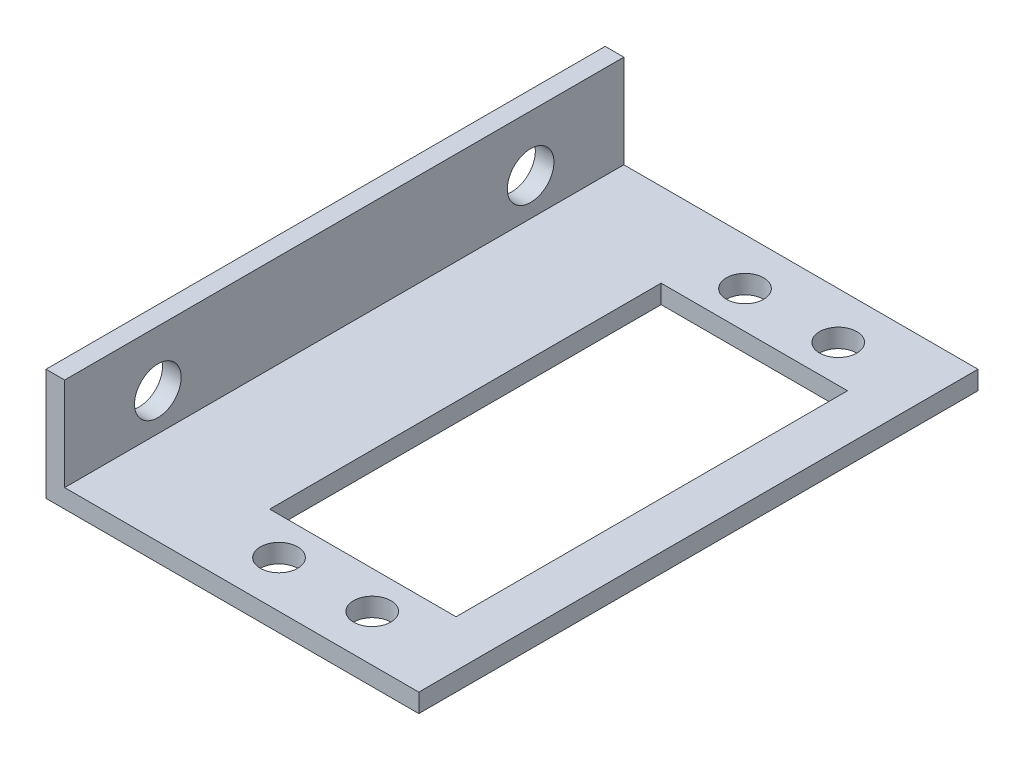
ISO-10303-21;
HEADER;
FILE_DESCRIPTION(('STEP AP214'),'2;1');
FILE_NAME('part.step','',(''),(''),'','','');
FILE_SCHEMA(('AUTOMOTIVE_DESIGN { 1 0 10303 214 1 1 1 1 }'));
ENDSEC;
DATA;
#1=APPLICATION_CONTEXT('core data for automotive mechanical design processes');
#2=APPLICATION_PROTOCOL_DEFINITION('international standard','automotive_design',2000,#1);
#3=PRODUCT_CONTEXT('',#1,'mechanical');
#4=PRODUCT('Part','Part','',(#3));
#5=PRODUCT_RELATED_PRODUCT_CATEGORY('part','',(#4));
#6=PRODUCT_DEFINITION_FORMATION('','',#4);
#7=PRODUCT_DEFINITION_CONTEXT('part definition',#1,'design');
#8=PRODUCT_DEFINITION('design','',#6,#7);
#9=PRODUCT_DEFINITION_SHAPE('','',#8);
#10=(LENGTH_UNIT() NAMED_UNIT(*) SI_UNIT(.MILLI.,.METRE.));
#11=(NAMED_UNIT(*) PLANE_ANGLE_UNIT() SI_UNIT($,.RADIAN.));
#12=(NAMED_UNIT(*) SI_UNIT($,.STERADIAN.) SOLID_ANGLE_UNIT());
#13=UNCERTAINTY_MEASURE_WITH_UNIT(LENGTH_MEASURE(1.E-05),#10,'distance_accuracy_value','');
#14=(GEOMETRIC_REPRESENTATION_CONTEXT(3) GLOBAL_UNCERTAINTY_ASSIGNED_CONTEXT((#13)) GLOBAL_UNIT_ASSIGNED_CONTEXT((#10,
#11,#12)) REPRESENTATION_CONTEXT('',''));
#15=CARTESIAN_POINT('',(0.,0.,0.));
#16=DIRECTION('',(0.,0.,1.));
#17=DIRECTION('',(1.,0.,0.));
#18=AXIS2_PLACEMENT_3D('',#15,#16,#17);
#19=CARTESIAN_POINT('',(22.2220554522577,2.,60.));
#20=DIRECTION('',(-1.,0.,0.));
#21=DIRECTION('',(0.,0.,1.));
#22=AXIS2_PLACEMENT_3D('',#19,#20,#21);
#23=PLANE('',#22);
#24=DIRECTION('',(0.,1.,0.));
#25=VECTOR('',#24,1.);
#26=CARTESIAN_POINT('',(22.2220554522577,2.,0.));
#27=LINE('',#26,#25);
#28=CARTESIAN_POINT('',(22.2220554522577,0.,0.));
#29=VERTEX_POINT('',#28);
#30=CARTESIAN_POINT('',(22.2220554522577,2.,0.));
#31=VERTEX_POINT('',#30);
#32=EDGE_CURVE('E196',#29,#31,#27,.T.);
#33=ORIENTED_EDGE('',*,*,#32,.T.);
#34=DIRECTION('',(0.,0.,-1.));
#35=VECTOR('',#34,1.);
#36=CARTESIAN_POINT('',(22.2220554522577,2.,60.));
#37=LINE('',#36,#35);
#38=CARTESIAN_POINT('',(22.2220554522577,2.,60.));
#39=VERTEX_POINT('',#38);
#40=EDGE_CURVE('E11',#39,#31,#37,.T.);
#41=ORIENTED_EDGE('',*,*,#40,.F.);
#42=DIRECTION('',(0.,1.,0.));
#43=VECTOR('',#42,1.);
#44=CARTESIAN_POINT('',(22.2220554522577,2.,60.));
#45=LINE('',#44,#43);
#46=CARTESIAN_POINT('',(22.2220554522577,0.,60.));
#47=VERTEX_POINT('',#46);
#48=EDGE_CURVE('E197',#47,#39,#45,.T.);
#49=ORIENTED_EDGE('',*,*,#48,.F.);
#50=DIRECTION('',(0.,0.,-1.));
#51=VECTOR('',#50,1.);
#52=CARTESIAN_POINT('',(22.2220554522577,0.,60.));
#53=LINE('',#52,#51);
#54=EDGE_CURVE('E217',#47,#29,#53,.T.);
#55=ORIENTED_EDGE('',*,*,#54,.T.);
#56=EDGE_LOOP('',(#33,#41,#49,#55));
#57=FACE_BOUND('',#56,.T.);
#58=ADVANCED_FACE('F39',(#57),#23,.F.);
#59=CARTESIAN_POINT('',(-15.7779445477423,2.,60.));
#60=DIRECTION('',(0.,-1.,0.));
#61=DIRECTION('',(0.,0.,-1.));
#62=AXIS2_PLACEMENT_3D('',#59,#60,#61);
#63=PLANE('',#62);
#64=CARTESIAN_POINT('',(12.2220554522577,1.99999999999999,5.));
#65=DIRECTION('',(0.,-1.,0.));
#66=DIRECTION('',(0.,0.,-1.));
#67=AXIS2_PLACEMENT_3D('',#64,#65,#66);
#68=CIRCLE('',#67,2.);
#69=CARTESIAN_POINT('',(12.2220554522577,1.99999999999999,3.));
#70=VERTEX_POINT('',#69);
#71=EDGE_CURVE('E176',#70,#70,#68,.T.);
#72=ORIENTED_EDGE('',*,*,#71,.T.);
#73=EDGE_LOOP('',(#72));
#74=FACE_BOUND('',#73,.T.);
#75=CARTESIAN_POINT('',(2.2220554522577,1.99999999999999,5.));
#76=DIRECTION('',(0.,-1.,0.));
#77=DIRECTION('',(0.,0.,-1.));
#78=AXIS2_PLACEMENT_3D('',#75,#76,#77);
#79=CIRCLE('',#78,2.);
#80=CARTESIAN_POINT('',(2.2220554522577,1.99999999999999,3.));
#81=VERTEX_POINT('',#80);
#82=EDGE_CURVE('E172',#81,#81,#79,.T.);
#83=ORIENTED_EDGE('',*,*,#82,.T.);
#84=EDGE_LOOP('',(#83));
#85=FACE_BOUND('',#84,.T.);
#86=CARTESIAN_POINT('',(12.2220554522577,1.99999999999999,55.));
#87=DIRECTION('',(0.,-1.,0.));
#88=DIRECTION('',(0.,0.,-1.));
#89=AXIS2_PLACEMENT_3D('',#86,#87,#88);
#90=CIRCLE('',#89,2.);
#91=CARTESIAN_POINT('',(12.2220554522577,1.99999999999999,53.));
#92=VERTEX_POINT('',#91);
#93=EDGE_CURVE('E168',#92,#92,#90,.T.);
#94=ORIENTED_EDGE('',*,*,#93,.T.);
#95=EDGE_LOOP('',(#94));
#96=FACE_BOUND('',#95,.T.);
#97=CARTESIAN_POINT('',(2.2220554522577,1.99999999999999,55.));
#98=DIRECTION('',(0.,-1.,0.));
#99=DIRECTION('',(0.,0.,-1.));
#100=AXIS2_PLACEMENT_3D('',#97,#98,#99);
#101=CIRCLE('',#100,2.);
#102=CARTESIAN_POINT('',(2.2220554522577,1.99999999999999,53.));
#103=VERTEX_POINT('',#102);
#104=EDGE_CURVE('E164',#103,#103,#101,.T.);
#105=ORIENTED_EDGE('',*,*,#104,.T.);
#106=EDGE_LOOP('',(#105));
#107=FACE_BOUND('',#106,.T.);
#108=DIRECTION('',(1.,0.,0.));
#109=VECTOR('',#108,1.);
#110=CARTESIAN_POINT('',(-15.7779445477423,2.,9.));
#111=LINE('',#110,#109);
#112=CARTESIAN_POINT('',(-2.7779445477423,1.99999999999999,9.));
#113=VERTEX_POINT('',#112);
#114=CARTESIAN_POINT('',(17.2220554522577,1.99999999999999,9.));
#115=VERTEX_POINT('',#114);
#116=EDGE_CURVE('E156',#113,#115,#111,.T.);
#117=ORIENTED_EDGE('',*,*,#116,.T.);
#118=DIRECTION('',(0.,0.,1.));
#119=VECTOR('',#118,1.);
#120=CARTESIAN_POINT('',(17.2220554522577,2.,60.));
#121=LINE('',#120,#119);
#122=CARTESIAN_POINT('',(17.2220554522577,1.99999999999999,51.));
#123=VERTEX_POINT('',#122);
#124=EDGE_CURVE('E160',#115,#123,#121,.T.);
#125=ORIENTED_EDGE('',*,*,#124,.T.);
#126=DIRECTION('',(-1.,0.,0.));
#127=VECTOR('',#126,1.);
#128=CARTESIAN_POINT('',(-15.7779445477423,2.,51.));
#129=LINE('',#128,#127);
#130=CARTESIAN_POINT('',(-2.7779445477423,2.,51.));
#131=VERTEX_POINT('',#130);
#132=EDGE_CURVE('E147',#123,#131,#129,.T.);
#133=ORIENTED_EDGE('',*,*,#132,.T.);
#134=DIRECTION('',(0.,0.,-1.));
#135=VECTOR('',#134,1.);
#136=CARTESIAN_POINT('',(-2.7779445477423,2.,60.));
#137=LINE('',#136,#135);
#138=EDGE_CURVE('E122',#131,#113,#137,.T.);
#139=ORIENTED_EDGE('',*,*,#138,.T.);
#140=EDGE_LOOP('',(#117,#125,#133,#139));
#141=FACE_BOUND('',#140,.T.);
#142=DIRECTION('',(-1.,0.,0.));
#143=VECTOR('',#142,1.);
#144=CARTESIAN_POINT('',(-15.7779445477423,2.,0.));
#145=LINE('',#144,#143);
#146=CARTESIAN_POINT('',(-15.7779445477423,2.,0.));
#147=VERTEX_POINT('',#146);
#148=EDGE_CURVE('E221',#31,#147,#145,.T.);
#149=ORIENTED_EDGE('',*,*,#148,.T.);
#150=DIRECTION('',(0.,0.,-1.));
#151=VECTOR('',#150,1.);
#152=CARTESIAN_POINT('',(-15.7779445477423,2.,60.));
#153=LINE('',#152,#151);
#154=CARTESIAN_POINT('',(-15.7779445477423,2.,60.));
#155=VERTEX_POINT('',#154);
#156=EDGE_CURVE('E47',#155,#147,#153,.T.);
#157=ORIENTED_EDGE('',*,*,#156,.F.);
#158=DIRECTION('',(-1.,0.,0.));
#159=VECTOR('',#158,1.);
#160=CARTESIAN_POINT('',(-15.7779445477423,2.,60.));
#161=LINE('',#160,#159);
#162=EDGE_CURVE('E201',#39,#155,#161,.T.);
#163=ORIENTED_EDGE('',*,*,#162,.F.);
#164=ORIENTED_EDGE('',*,*,#40,.T.);
#165=EDGE_LOOP('',(#149,#157,#163,#164));
#166=FACE_BOUND('',#165,.T.);
#167=ADVANCED_FACE('F278',(#74,#85,#96,#107,#141,#166),#63,.F.);
#168=CARTESIAN_POINT('',(-15.7779445477423,12.,60.));
#169=DIRECTION('',(-1.,0.,0.));
#170=DIRECTION('',(0.,0.,1.));
#171=AXIS2_PLACEMENT_3D('',#168,#169,#170);
#172=PLANE('',#171);
#173=CARTESIAN_POINT('',(-15.7779445477423,6.,10.));
#174=DIRECTION('',(-1.,0.,0.));
#175=DIRECTION('',(0.,0.,1.));
#176=AXIS2_PLACEMENT_3D('',#173,#174,#175);
#177=CIRCLE('',#176,2.5);
#178=CARTESIAN_POINT('',(-15.7779445477423,6.,12.5));
#179=VERTEX_POINT('',#178);
#180=EDGE_CURVE('E192',#179,#179,#177,.T.);
#181=ORIENTED_EDGE('',*,*,#180,.T.);
#182=EDGE_LOOP('',(#181));
#183=FACE_BOUND('',#182,.T.);
#184=CARTESIAN_POINT('',(-15.7779445477423,6.,50.));
#185=DIRECTION('',(-1.,0.,0.));
#186=DIRECTION('',(0.,0.,1.));
#187=AXIS2_PLACEMENT_3D('',#184,#185,#186);
#188=CIRCLE('',#187,2.5);
#189=CARTESIAN_POINT('',(-15.7779445477423,6.,52.5));
#190=VERTEX_POINT('',#189);
#191=EDGE_CURVE('E185',#190,#190,#188,.T.);
#192=ORIENTED_EDGE('',*,*,#191,.T.);
#193=EDGE_LOOP('',(#192));
#194=FACE_BOUND('',#193,.T.);
#195=DIRECTION('',(0.,1.,0.));
#196=VECTOR('',#195,1.);
#197=CARTESIAN_POINT('',(-15.7779445477423,12.,0.));
#198=LINE('',#197,#196);
#199=CARTESIAN_POINT('',(-15.7779445477423,12.,0.));
#200=VERTEX_POINT('',#199);
#201=EDGE_CURVE('E224',#147,#200,#198,.T.);
#202=ORIENTED_EDGE('',*,*,#201,.T.);
#203=DIRECTION('',(0.,0.,-1.));
#204=VECTOR('',#203,1.);
#205=CARTESIAN_POINT('',(-15.7779445477423,12.,60.));
#206=LINE('',#205,#204);
#207=CARTESIAN_POINT('',(-15.7779445477423,12.,60.));
#208=VERTEX_POINT('',#207);
#209=EDGE_CURVE('E246',#208,#200,#206,.T.);
#210=ORIENTED_EDGE('',*,*,#209,.F.);
#211=DIRECTION('',(0.,1.,0.));
#212=VECTOR('',#211,1.);
#213=CARTESIAN_POINT('',(-15.7779445477423,12.,60.));
#214=LINE('',#213,#212);
#215=EDGE_CURVE('E205',#155,#208,#214,.T.);
#216=ORIENTED_EDGE('',*,*,#215,.F.);
#217=ORIENTED_EDGE('',*,*,#156,.T.);
#218=EDGE_LOOP('',(#202,#210,#216,#217));
#219=FACE_BOUND('',#218,.T.);
#220=ADVANCED_FACE('F255',(#183,#194,#219),#172,.F.);
#221=CARTESIAN_POINT('',(-17.7779445477423,12.,60.));
#222=DIRECTION('',(0.,-1.,0.));
#223=DIRECTION('',(0.,0.,-1.));
#224=AXIS2_PLACEMENT_3D('',#221,#222,#223);
#225=PLANE('',#224);
#226=DIRECTION('',(-1.,0.,0.));
#227=VECTOR('',#226,1.);
#228=CARTESIAN_POINT('',(-17.7779445477423,12.,0.));
#229=LINE('',#228,#227);
#230=CARTESIAN_POINT('',(-17.7779445477423,12.,0.));
#231=VERTEX_POINT('',#230);
#232=EDGE_CURVE('E227',#200,#231,#229,.T.);
#233=ORIENTED_EDGE('',*,*,#232,.T.);
#234=DIRECTION('',(0.,0.,-1.));
#235=VECTOR('',#234,1.);
#236=CARTESIAN_POINT('',(-17.7779445477423,12.,60.));
#237=LINE('',#236,#235);
#238=CARTESIAN_POINT('',(-17.7779445477423,12.,60.));
#239=VERTEX_POINT('',#238);
#240=EDGE_CURVE('E242',#239,#231,#237,.T.);
#241=ORIENTED_EDGE('',*,*,#240,.F.);
#242=DIRECTION('',(-1.,0.,0.));
#243=VECTOR('',#242,1.);
#244=CARTESIAN_POINT('',(-17.7779445477423,12.,60.));
#245=LINE('',#244,#243);
#246=EDGE_CURVE('E208',#208,#239,#245,.T.);
#247=ORIENTED_EDGE('',*,*,#246,.F.);
#248=ORIENTED_EDGE('',*,*,#209,.T.);
#249=EDGE_LOOP('',(#233,#241,#247,#248));
#250=FACE_BOUND('',#249,.T.);
#251=ADVANCED_FACE('F266',(#250),#225,.F.);
#252=CARTESIAN_POINT('',(-17.7779445477423,0.,60.));
#253=DIRECTION('',(1.,0.,0.));
#254=DIRECTION('',(0.,0.,-1.));
#255=AXIS2_PLACEMENT_3D('',#252,#253,#254);
#256=PLANE('',#255);
#257=CARTESIAN_POINT('',(-17.7779445477423,6.,10.));
#258=DIRECTION('',(-1.,0.,0.));
#259=DIRECTION('',(0.,0.,1.));
#260=AXIS2_PLACEMENT_3D('',#257,#258,#259);
#261=CIRCLE('',#260,2.5);
#262=CARTESIAN_POINT('',(-17.7779445477423,6.,12.5));
#263=VERTEX_POINT('',#262);
#264=EDGE_CURVE('E181',#263,#263,#261,.T.);
#265=ORIENTED_EDGE('',*,*,#264,.F.);
#266=EDGE_LOOP('',(#265));
#267=FACE_BOUND('',#266,.T.);
#268=CARTESIAN_POINT('',(-17.7779445477423,6.,50.));
#269=DIRECTION('',(-1.,0.,0.));
#270=DIRECTION('',(0.,0.,1.));
#271=AXIS2_PLACEMENT_3D('',#268,#269,#270);
#272=CIRCLE('',#271,2.5);
#273=CARTESIAN_POINT('',(-17.7779445477423,6.,52.5));
#274=VERTEX_POINT('',#273);
#275=EDGE_CURVE('E180',#274,#274,#272,.T.);
#276=ORIENTED_EDGE('',*,*,#275,.F.);
#277=EDGE_LOOP('',(#276));
#278=FACE_BOUND('',#277,.T.);
#279=DIRECTION('',(0.,-1.,0.));
#280=VECTOR('',#279,1.);
#281=CARTESIAN_POINT('',(-17.7779445477423,0.,0.));
#282=LINE('',#281,#280);
#283=CARTESIAN_POINT('',(-17.7779445477423,0.,0.));
#284=VERTEX_POINT('',#283);
#285=EDGE_CURVE('E230',#231,#284,#282,.T.);
#286=ORIENTED_EDGE('',*,*,#285,.T.);
#287=DIRECTION('',(0.,0.,-1.));
#288=VECTOR('',#287,1.);
#289=CARTESIAN_POINT('',(-17.7779445477423,0.,60.));
#290=LINE('',#289,#288);
#291=CARTESIAN_POINT('',(-17.7779445477423,0.,60.));
#292=VERTEX_POINT('',#291);
#293=EDGE_CURVE('E238',#292,#284,#290,.T.);
#294=ORIENTED_EDGE('',*,*,#293,.F.);
#295=DIRECTION('',(0.,-1.,0.));
#296=VECTOR('',#295,1.);
#297=CARTESIAN_POINT('',(-17.7779445477423,0.,60.));
#298=LINE('',#297,#296);
#299=EDGE_CURVE('E211',#239,#292,#298,.T.);
#300=ORIENTED_EDGE('',*,*,#299,.F.);
#301=ORIENTED_EDGE('',*,*,#240,.T.);
#302=EDGE_LOOP('',(#286,#294,#300,#301));
#303=FACE_BOUND('',#302,.T.);
#304=ADVANCED_FACE('F270',(#267,#278,#303),#256,.F.);
#305=CARTESIAN_POINT('',(22.2220554522577,0.,60.));
#306=DIRECTION('',(0.,1.,0.));
#307=DIRECTION('',(-1.,0.,0.));
#308=AXIS2_PLACEMENT_3D('',#305,#306,#307);
#309=PLANE('',#308);
#310=CARTESIAN_POINT('',(12.2220554522577,0.,5.));
#311=DIRECTION('',(0.,-1.,0.));
#312=DIRECTION('',(0.,0.,-1.));
#313=AXIS2_PLACEMENT_3D('',#310,#311,#312);
#314=CIRCLE('',#313,2.);
#315=CARTESIAN_POINT('',(12.2220554522577,0.,3.));
#316=VERTEX_POINT('',#315);
#317=EDGE_CURVE('E439',#316,#316,#314,.T.);
#318=ORIENTED_EDGE('',*,*,#317,.F.);
#319=EDGE_LOOP('',(#318));
#320=FACE_BOUND('',#319,.T.);
#321=CARTESIAN_POINT('',(2.2220554522577,0.,5.));
#322=DIRECTION('',(0.,-1.,0.));
#323=DIRECTION('',(0.,0.,-1.));
#324=AXIS2_PLACEMENT_3D('',#321,#322,#323);
#325=CIRCLE('',#324,2.);
#326=CARTESIAN_POINT('',(2.2220554522577,0.,3.));
#327=VERTEX_POINT('',#326);
#328=EDGE_CURVE('E442',#327,#327,#325,.T.);
#329=ORIENTED_EDGE('',*,*,#328,.F.);
#330=EDGE_LOOP('',(#329));
#331=FACE_BOUND('',#330,.T.);
#332=CARTESIAN_POINT('',(12.2220554522577,0.,55.));
#333=DIRECTION('',(0.,-1.,0.));
#334=DIRECTION('',(0.,0.,-1.));
#335=AXIS2_PLACEMENT_3D('',#332,#333,#334);
#336=CIRCLE('',#335,2.);
#337=CARTESIAN_POINT('',(12.2220554522577,0.,53.));
#338=VERTEX_POINT('',#337);
#339=EDGE_CURVE('E446',#338,#338,#336,.T.);
#340=ORIENTED_EDGE('',*,*,#339,.F.);
#341=EDGE_LOOP('',(#340));
#342=FACE_BOUND('',#341,.T.);
#343=CARTESIAN_POINT('',(2.2220554522577,0.,55.));
#344=DIRECTION('',(0.,-1.,0.));
#345=DIRECTION('',(0.,0.,-1.));
#346=AXIS2_PLACEMENT_3D('',#343,#344,#345);
#347=CIRCLE('',#346,2.);
#348=CARTESIAN_POINT('',(2.2220554522577,0.,53.));
#349=VERTEX_POINT('',#348);
#350=EDGE_CURVE('E450',#349,#349,#347,.T.);
#351=ORIENTED_EDGE('',*,*,#350,.F.);
#352=EDGE_LOOP('',(#351));
#353=FACE_BOUND('',#352,.T.);
#354=DIRECTION('',(-1.,0.,0.));
#355=VECTOR('',#354,1.);
#356=CARTESIAN_POINT('',(-2.7779445477423,0.,51.));
#357=LINE('',#356,#355);
#358=CARTESIAN_POINT('',(17.2220554522577,0.,51.));
#359=VERTEX_POINT('',#358);
#360=CARTESIAN_POINT('',(-2.7779445477423,0.,51.));
#361=VERTEX_POINT('',#360);
#362=EDGE_CURVE('E129',#359,#361,#357,.T.);
#363=ORIENTED_EDGE('',*,*,#362,.F.);
#364=DIRECTION('',(0.,0.,1.));
#365=VECTOR('',#364,1.);
#366=CARTESIAN_POINT('',(17.2220554522577,0.,51.));
#367=LINE('',#366,#365);
#368=CARTESIAN_POINT('',(17.2220554522577,0.,9.));
#369=VERTEX_POINT('',#368);
#370=EDGE_CURVE('E62',#369,#359,#367,.T.);
#371=ORIENTED_EDGE('',*,*,#370,.F.);
#372=DIRECTION('',(1.,0.,0.));
#373=VECTOR('',#372,1.);
#374=CARTESIAN_POINT('',(-2.7779445477423,0.,9.));
#375=LINE('',#374,#373);
#376=CARTESIAN_POINT('',(-2.7779445477423,0.,9.));
#377=VERTEX_POINT('',#376);
#378=EDGE_CURVE('E137',#377,#369,#375,.T.);
#379=ORIENTED_EDGE('',*,*,#378,.F.);
#380=DIRECTION('',(0.,0.,-1.));
#381=VECTOR('',#380,1.);
#382=CARTESIAN_POINT('',(-2.7779445477423,0.,51.));
#383=LINE('',#382,#381);
#384=EDGE_CURVE('E119',#361,#377,#383,.T.);
#385=ORIENTED_EDGE('',*,*,#384,.F.);
#386=EDGE_LOOP('',(#363,#371,#379,#385));
#387=FACE_BOUND('',#386,.T.);
#388=DIRECTION('',(1.,0.,0.));
#389=VECTOR('',#388,1.);
#390=CARTESIAN_POINT('',(22.2220554522577,0.,0.));
#391=LINE('',#390,#389);
#392=EDGE_CURVE('E202',#284,#29,#391,.T.);
#393=ORIENTED_EDGE('',*,*,#392,.T.);
#394=ORIENTED_EDGE('',*,*,#54,.F.);
#395=DIRECTION('',(1.,0.,0.));
#396=VECTOR('',#395,1.);
#397=CARTESIAN_POINT('',(22.2220554522577,0.,60.));
#398=LINE('',#397,#396);
#399=EDGE_CURVE('E214',#292,#47,#398,.T.);
#400=ORIENTED_EDGE('',*,*,#399,.F.);
#401=ORIENTED_EDGE('',*,*,#293,.T.);
#402=EDGE_LOOP('',(#393,#394,#400,#401));
#403=FACE_BOUND('',#402,.T.);
#404=ADVANCED_FACE('F134',(#320,#331,#342,#353,#387,#403),#309,.F.);
#405=CARTESIAN_POINT('',(0.,0.,60.));
#406=DIRECTION('',(0.,0.,-1.));
#407=DIRECTION('',(-1.,0.,0.));
#408=AXIS2_PLACEMENT_3D('',#405,#406,#407);
#409=PLANE('',#408);
#410=ORIENTED_EDGE('',*,*,#48,.T.);
#411=ORIENTED_EDGE('',*,*,#162,.T.);
#412=ORIENTED_EDGE('',*,*,#215,.T.);
#413=ORIENTED_EDGE('',*,*,#246,.T.);
#414=ORIENTED_EDGE('',*,*,#299,.T.);
#415=ORIENTED_EDGE('',*,*,#399,.T.);
#416=EDGE_LOOP('',(#410,#411,#412,#413,#414,#415));
#417=FACE_BOUND('',#416,.T.);
#418=ADVANCED_FACE('F274',(#417),#409,.F.);
#419=CARTESIAN_POINT('',(0.,0.,0.));
#420=DIRECTION('',(0.,0.,-1.));
#421=DIRECTION('',(-1.,0.,0.));
#422=AXIS2_PLACEMENT_3D('',#419,#420,#421);
#423=PLANE('',#422);
#424=ORIENTED_EDGE('',*,*,#32,.F.);
#425=ORIENTED_EDGE('',*,*,#392,.F.);
#426=ORIENTED_EDGE('',*,*,#285,.F.);
#427=ORIENTED_EDGE('',*,*,#232,.F.);
#428=ORIENTED_EDGE('',*,*,#201,.F.);
#429=ORIENTED_EDGE('',*,*,#148,.F.);
#430=EDGE_LOOP('',(#424,#425,#426,#427,#428,#429));
#431=FACE_BOUND('',#430,.T.);
#432=ADVANCED_FACE('F261',(#431),#423,.T.);
#433=CARTESIAN_POINT('',(42.2220554522577,6.,50.));
#434=DIRECTION('',(-1.,0.,0.));
#435=DIRECTION('',(0.,0.,1.));
#436=AXIS2_PLACEMENT_3D('',#433,#434,#435);
#437=CYLINDRICAL_SURFACE('',#436,2.5);
#438=ORIENTED_EDGE('',*,*,#275,.T.);
#439=EDGE_LOOP('',(#438));
#440=FACE_BOUND('',#439,.T.);
#441=ORIENTED_EDGE('',*,*,#191,.F.);
#442=EDGE_LOOP('',(#441));
#443=FACE_BOUND('',#442,.T.);
#444=ADVANCED_FACE('F324',(#440,#443),#437,.F.);
#445=CARTESIAN_POINT('',(42.2220554522577,6.,10.));
#446=DIRECTION('',(-1.,0.,0.));
#447=DIRECTION('',(0.,0.,1.));
#448=AXIS2_PLACEMENT_3D('',#445,#446,#447);
#449=CYLINDRICAL_SURFACE('',#448,2.5);
#450=ORIENTED_EDGE('',*,*,#264,.T.);
#451=EDGE_LOOP('',(#450));
#452=FACE_BOUND('',#451,.T.);
#453=ORIENTED_EDGE('',*,*,#180,.F.);
#454=EDGE_LOOP('',(#453));
#455=FACE_BOUND('',#454,.T.);
#456=ADVANCED_FACE('F329',(#452,#455),#449,.F.);
#457=CARTESIAN_POINT('',(17.2220554522577,60.,51.));
#458=DIRECTION('',(1.,0.,0.));
#459=DIRECTION('',(0.,0.,-1.));
#460=AXIS2_PLACEMENT_3D('',#457,#458,#459);
#461=PLANE('',#460);
#462=DIRECTION('',(0.,-1.,0.));
#463=VECTOR('',#462,1.);
#464=CARTESIAN_POINT('',(17.2220554522577,60.,9.));
#465=LINE('',#464,#463);
#466=EDGE_CURVE('E144',#115,#369,#465,.T.);
#467=ORIENTED_EDGE('',*,*,#466,.T.);
#468=ORIENTED_EDGE('',*,*,#370,.T.);
#469=DIRECTION('',(0.,-1.,0.));
#470=VECTOR('',#469,1.);
#471=CARTESIAN_POINT('',(17.2220554522577,60.,51.));
#472=LINE('',#471,#470);
#473=EDGE_CURVE('E126',#123,#359,#472,.T.);
#474=ORIENTED_EDGE('',*,*,#473,.F.);
#475=ORIENTED_EDGE('',*,*,#124,.F.);
#476=EDGE_LOOP('',(#467,#468,#474,#475));
#477=FACE_BOUND('',#476,.T.);
#478=ADVANCED_FACE('F340',(#477),#461,.F.);
#479=CARTESIAN_POINT('',(-2.7779445477423,60.,9.));
#480=DIRECTION('',(0.,0.,-1.));
#481=DIRECTION('',(-1.,0.,0.));
#482=AXIS2_PLACEMENT_3D('',#479,#480,#481);
#483=PLANE('',#482);
#484=DIRECTION('',(0.,-1.,0.));
#485=VECTOR('',#484,1.);
#486=CARTESIAN_POINT('',(-2.7779445477423,60.,9.));
#487=LINE('',#486,#485);
#488=EDGE_CURVE('E125',#113,#377,#487,.T.);
#489=ORIENTED_EDGE('',*,*,#488,.T.);
#490=ORIENTED_EDGE('',*,*,#378,.T.);
#491=ORIENTED_EDGE('',*,*,#466,.F.);
#492=ORIENTED_EDGE('',*,*,#116,.F.);
#493=EDGE_LOOP('',(#489,#490,#491,#492));
#494=FACE_BOUND('',#493,.T.);
#495=ADVANCED_FACE('F360',(#494),#483,.F.);
#496=CARTESIAN_POINT('',(-2.7779445477423,60.,51.));
#497=DIRECTION('',(-1.,0.,0.));
#498=DIRECTION('',(0.,0.,1.));
#499=AXIS2_PLACEMENT_3D('',#496,#497,#498);
#500=PLANE('',#499);
#501=DIRECTION('',(0.,-1.,0.));
#502=VECTOR('',#501,1.);
#503=CARTESIAN_POINT('',(-2.7779445477423,60.,51.));
#504=LINE('',#503,#502);
#505=EDGE_CURVE('E54',#131,#361,#504,.T.);
#506=ORIENTED_EDGE('',*,*,#505,.T.);
#507=ORIENTED_EDGE('',*,*,#384,.T.);
#508=ORIENTED_EDGE('',*,*,#488,.F.);
#509=ORIENTED_EDGE('',*,*,#138,.F.);
#510=EDGE_LOOP('',(#506,#507,#508,#509));
#511=FACE_BOUND('',#510,.T.);
#512=ADVANCED_FACE('F116',(#511),#500,.F.);
#513=CARTESIAN_POINT('',(-2.7779445477423,60.,51.));
#514=DIRECTION('',(0.,0.,1.));
#515=DIRECTION('',(1.,0.,0.));
#516=AXIS2_PLACEMENT_3D('',#513,#514,#515);
#517=PLANE('',#516);
#518=ORIENTED_EDGE('',*,*,#473,.T.);
#519=ORIENTED_EDGE('',*,*,#362,.T.);
#520=ORIENTED_EDGE('',*,*,#505,.F.);
#521=ORIENTED_EDGE('',*,*,#132,.F.);
#522=EDGE_LOOP('',(#518,#519,#520,#521));
#523=FACE_BOUND('',#522,.T.);
#524=ADVANCED_FACE('F130',(#523),#517,.F.);
#525=CARTESIAN_POINT('',(2.2220554522577,60.,55.));
#526=DIRECTION('',(0.,-1.,0.));
#527=DIRECTION('',(0.,0.,-1.));
#528=AXIS2_PLACEMENT_3D('',#525,#526,#527);
#529=CYLINDRICAL_SURFACE('',#528,2.);
#530=ORIENTED_EDGE('',*,*,#350,.T.);
#531=EDGE_LOOP('',(#530));
#532=FACE_BOUND('',#531,.T.);
#533=ORIENTED_EDGE('',*,*,#104,.F.);
#534=EDGE_LOOP('',(#533));
#535=FACE_BOUND('',#534,.T.);
#536=ADVANCED_FACE('F386',(#532,#535),#529,.F.);
#537=CARTESIAN_POINT('',(12.2220554522577,60.,55.));
#538=DIRECTION('',(0.,-1.,0.));
#539=DIRECTION('',(0.,0.,-1.));
#540=AXIS2_PLACEMENT_3D('',#537,#538,#539);
#541=CYLINDRICAL_SURFACE('',#540,2.);
#542=ORIENTED_EDGE('',*,*,#339,.T.);
#543=EDGE_LOOP('',(#542));
#544=FACE_BOUND('',#543,.T.);
#545=ORIENTED_EDGE('',*,*,#93,.F.);
#546=EDGE_LOOP('',(#545));
#547=FACE_BOUND('',#546,.T.);
#548=ADVANCED_FACE('F395',(#544,#547),#541,.F.);
#549=CARTESIAN_POINT('',(2.2220554522577,60.,5.));
#550=DIRECTION('',(0.,-1.,0.));
#551=DIRECTION('',(0.,0.,-1.));
#552=AXIS2_PLACEMENT_3D('',#549,#550,#551);
#553=CYLINDRICAL_SURFACE('',#552,2.);
#554=ORIENTED_EDGE('',*,*,#328,.T.);
#555=EDGE_LOOP('',(#554));
#556=FACE_BOUND('',#555,.T.);
#557=ORIENTED_EDGE('',*,*,#82,.F.);
#558=EDGE_LOOP('',(#557));
#559=FACE_BOUND('',#558,.T.);
#560=ADVANCED_FACE('F405',(#556,#559),#553,.F.);
#561=CARTESIAN_POINT('',(12.2220554522577,60.,5.));
#562=DIRECTION('',(0.,-1.,0.));
#563=DIRECTION('',(0.,0.,-1.));
#564=AXIS2_PLACEMENT_3D('',#561,#562,#563);
#565=CYLINDRICAL_SURFACE('',#564,2.);
#566=ORIENTED_EDGE('',*,*,#317,.T.);
#567=EDGE_LOOP('',(#566));
#568=FACE_BOUND('',#567,.T.);
#569=ORIENTED_EDGE('',*,*,#71,.F.);
#570=EDGE_LOOP('',(#569));
#571=FACE_BOUND('',#570,.T.);
#572=ADVANCED_FACE('F415',(#568,#571),#565,.F.);
#573=CLOSED_SHELL('',(#58,#167,#220,#251,#304,#404,#418,#432,#444,#456,#478,#495,#512,#524,#536,
#548,#560,#572));
#574=MANIFOLD_SOLID_BREP('B2',#573);
#575=ADVANCED_BREP_SHAPE_REPRESENTATION('',(#18,#574),#14);
#576=SHAPE_DEFINITION_REPRESENTATION(#9,#575);
ENDSEC;
END-ISO-10303-21;
